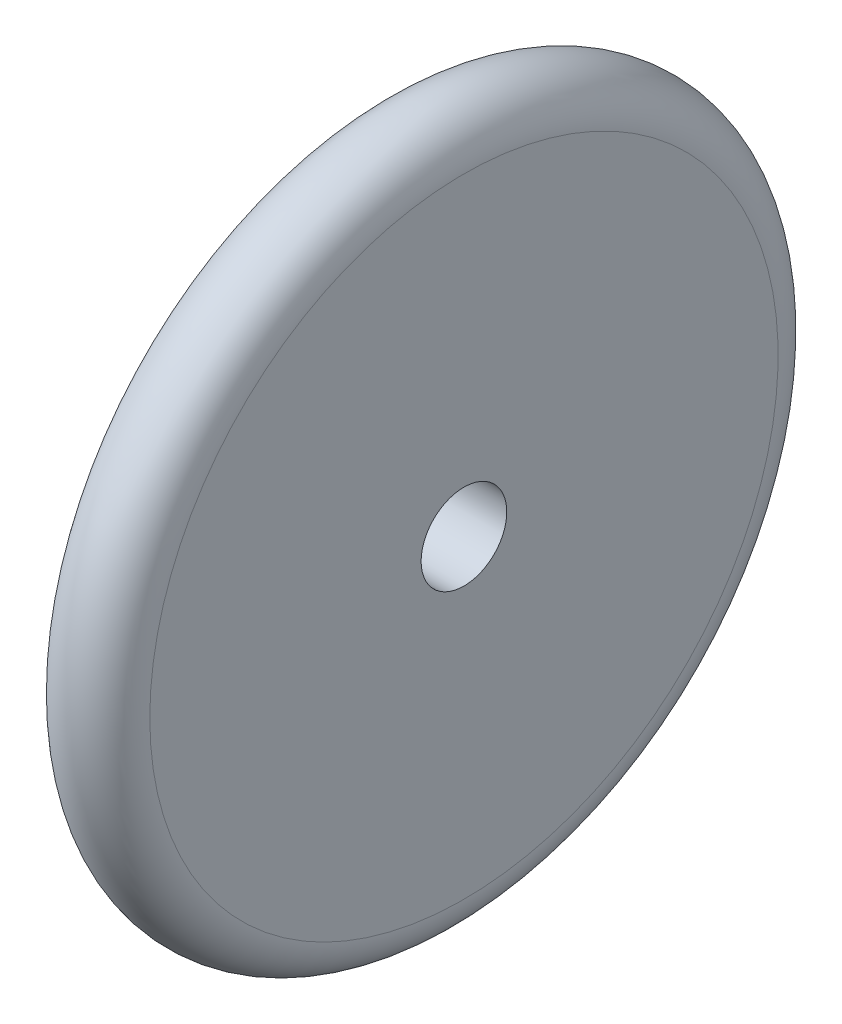
ISO-10303-21;
HEADER;
FILE_DESCRIPTION(('STEP AP214'),'2;1');
FILE_NAME('part.step','',(''),(''),'','','');
FILE_SCHEMA(('AUTOMOTIVE_DESIGN { 1 0 10303 214 1 1 1 1 }'));
ENDSEC;
DATA;
#1=APPLICATION_CONTEXT('core data for automotive mechanical design processes');
#2=APPLICATION_PROTOCOL_DEFINITION('international standard','automotive_design',2000,#1);
#3=PRODUCT_CONTEXT('',#1,'mechanical');
#4=PRODUCT('Part','Part','',(#3));
#5=PRODUCT_RELATED_PRODUCT_CATEGORY('part','',(#4));
#6=PRODUCT_DEFINITION_FORMATION('','',#4);
#7=PRODUCT_DEFINITION_CONTEXT('part definition',#1,'design');
#8=PRODUCT_DEFINITION('design','',#6,#7);
#9=PRODUCT_DEFINITION_SHAPE('','',#8);
#10=(LENGTH_UNIT() NAMED_UNIT(*) SI_UNIT(.MILLI.,.METRE.));
#11=(NAMED_UNIT(*) PLANE_ANGLE_UNIT() SI_UNIT($,.RADIAN.));
#12=(NAMED_UNIT(*) SI_UNIT($,.STERADIAN.) SOLID_ANGLE_UNIT());
#13=UNCERTAINTY_MEASURE_WITH_UNIT(LENGTH_MEASURE(1.E-05),#10,'distance_accuracy_value','');
#14=(GEOMETRIC_REPRESENTATION_CONTEXT(3) GLOBAL_UNCERTAINTY_ASSIGNED_CONTEXT((#13)) GLOBAL_UNIT_ASSIGNED_CONTEXT((#10,
#11,#12)) REPRESENTATION_CONTEXT('',''));
#15=CARTESIAN_POINT('',(0.,0.,0.));
#16=DIRECTION('',(0.,0.,1.));
#17=DIRECTION('',(1.,0.,0.));
#18=AXIS2_PLACEMENT_3D('',#15,#16,#17);
#19=CARTESIAN_POINT('',(15.,0.,0.));
#20=DIRECTION('',(-1.,0.,0.));
#21=DIRECTION('',(0.,0.,1.));
#22=AXIS2_PLACEMENT_3D('',#19,#20,#21);
#23=TOROIDAL_SURFACE('',#22,110.,15.);
#24=CARTESIAN_POINT('',(30.,0.,0.));
#25=DIRECTION('',(-1.,0.,0.));
#26=DIRECTION('',(0.,0.,1.));
#27=AXIS2_PLACEMENT_3D('',#24,#25,#26);
#28=CIRCLE('',#27,110.);
#29=CARTESIAN_POINT('',(30.,0.,110.));
#30=VERTEX_POINT('',#29);
#31=EDGE_CURVE('E45',#30,#30,#28,.T.);
#32=ORIENTED_EDGE('',*,*,#31,.T.);
#33=EDGE_LOOP('',(#32));
#34=FACE_BOUND('',#33,.T.);
#35=CARTESIAN_POINT('',(0.,0.,0.));
#36=DIRECTION('',(-1.,0.,0.));
#37=DIRECTION('',(0.,0.,1.));
#38=AXIS2_PLACEMENT_3D('',#35,#36,#37);
#39=CIRCLE('',#38,110.);
#40=CARTESIAN_POINT('',(0.,0.,110.));
#41=VERTEX_POINT('',#40);
#42=EDGE_CURVE('E10',#41,#41,#39,.T.);
#43=ORIENTED_EDGE('',*,*,#42,.F.);
#44=EDGE_LOOP('',(#43));
#45=FACE_BOUND('',#44,.T.);
#46=ADVANCED_FACE('F31',(#34,#45),#23,.T.);
#47=CARTESIAN_POINT('',(0.,0.,0.));
#48=DIRECTION('',(-1.,0.,0.));
#49=DIRECTION('',(0.,0.,1.));
#50=AXIS2_PLACEMENT_3D('',#47,#48,#49);
#51=PLANE('',#50);
#52=ORIENTED_EDGE('',*,*,#42,.T.);
#53=EDGE_LOOP('',(#52));
#54=FACE_BOUND('',#53,.T.);
#55=CARTESIAN_POINT('',(0.,0.,0.));
#56=DIRECTION('',(-1.,0.,0.));
#57=DIRECTION('',(0.,0.,1.));
#58=AXIS2_PLACEMENT_3D('',#55,#56,#57);
#59=CIRCLE('',#58,15.);
#60=CARTESIAN_POINT('',(0.,0.,15.));
#61=VERTEX_POINT('',#60);
#62=EDGE_CURVE('E37',#61,#61,#59,.T.);
#63=ORIENTED_EDGE('',*,*,#62,.F.);
#64=EDGE_LOOP('',(#63));
#65=FACE_BOUND('',#64,.T.);
#66=ADVANCED_FACE('F61',(#54,#65),#51,.T.);
#67=CARTESIAN_POINT('',(0.,0.,0.));
#68=DIRECTION('',(-1.,0.,0.));
#69=DIRECTION('',(0.,0.,1.));
#70=AXIS2_PLACEMENT_3D('',#67,#68,#69);
#71=CYLINDRICAL_SURFACE('',#70,15.);
#72=CARTESIAN_POINT('',(30.,0.,0.));
#73=DIRECTION('',(-1.,0.,0.));
#74=DIRECTION('',(0.,0.,1.));
#75=AXIS2_PLACEMENT_3D('',#72,#73,#74);
#76=CIRCLE('',#75,15.);
#77=CARTESIAN_POINT('',(30.,0.,15.));
#78=VERTEX_POINT('',#77);
#79=EDGE_CURVE('E41',#78,#78,#76,.T.);
#80=ORIENTED_EDGE('',*,*,#79,.F.);
#81=EDGE_LOOP('',(#80));
#82=FACE_BOUND('',#81,.T.);
#83=ORIENTED_EDGE('',*,*,#62,.T.);
#84=EDGE_LOOP('',(#83));
#85=FACE_BOUND('',#84,.T.);
#86=ADVANCED_FACE('F56',(#82,#85),#71,.F.);
#87=CARTESIAN_POINT('',(30.,0.,0.));
#88=DIRECTION('',(-1.,0.,0.));
#89=DIRECTION('',(0.,0.,1.));
#90=AXIS2_PLACEMENT_3D('',#87,#88,#89);
#91=PLANE('',#90);
#92=ORIENTED_EDGE('',*,*,#31,.F.);
#93=EDGE_LOOP('',(#92));
#94=FACE_BOUND('',#93,.T.);
#95=ORIENTED_EDGE('',*,*,#79,.T.);
#96=EDGE_LOOP('',(#95));
#97=FACE_BOUND('',#96,.T.);
#98=ADVANCED_FACE('F53',(#94,#97),#91,.F.);
#99=CLOSED_SHELL('',(#46,#66,#86,#98));
#100=MANIFOLD_SOLID_BREP('B2',#99);
#101=ADVANCED_BREP_SHAPE_REPRESENTATION('',(#18,#100),#14);
#102=SHAPE_DEFINITION_REPRESENTATION(#9,#101);
ENDSEC;
END-ISO-10303-21;
